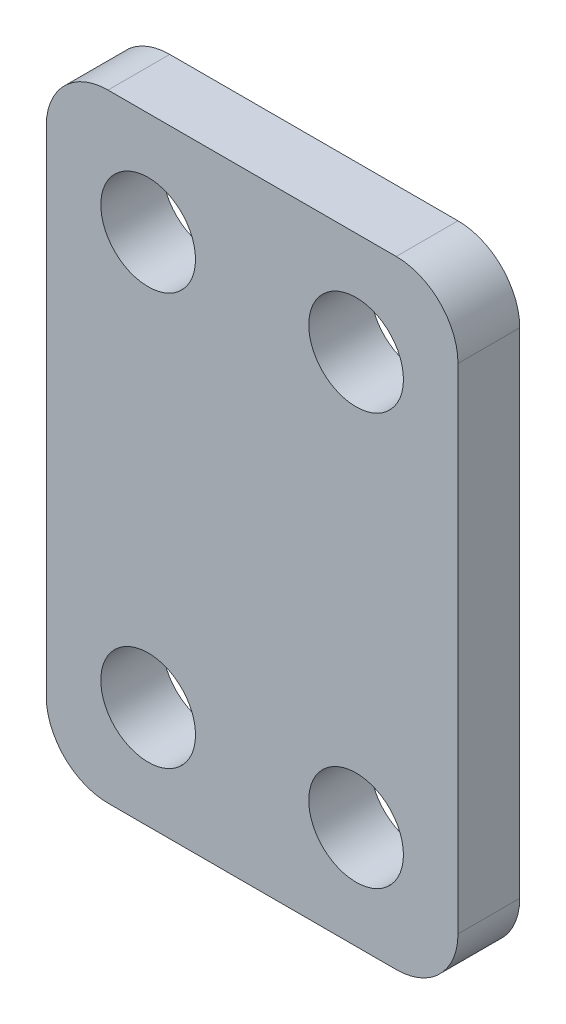
ISO-10303-21;
HEADER;
FILE_DESCRIPTION(('STEP AP214'),'2;1');
FILE_NAME('part.step','',(''),(''),'','','');
FILE_SCHEMA(('AUTOMOTIVE_DESIGN { 1 0 10303 214 1 1 1 1 }'));
ENDSEC;
DATA;
#1=APPLICATION_CONTEXT('core data for automotive mechanical design processes');
#2=APPLICATION_PROTOCOL_DEFINITION('international standard','automotive_design',2000,#1);
#3=PRODUCT_CONTEXT('',#1,'mechanical');
#4=PRODUCT('Part','Part','',(#3));
#5=PRODUCT_RELATED_PRODUCT_CATEGORY('part','',(#4));
#6=PRODUCT_DEFINITION_FORMATION('','',#4);
#7=PRODUCT_DEFINITION_CONTEXT('part definition',#1,'design');
#8=PRODUCT_DEFINITION('design','',#6,#7);
#9=PRODUCT_DEFINITION_SHAPE('','',#8);
#10=(LENGTH_UNIT() NAMED_UNIT(*) SI_UNIT(.MILLI.,.METRE.));
#11=(NAMED_UNIT(*) PLANE_ANGLE_UNIT() SI_UNIT($,.RADIAN.));
#12=(NAMED_UNIT(*) SI_UNIT($,.STERADIAN.) SOLID_ANGLE_UNIT());
#13=UNCERTAINTY_MEASURE_WITH_UNIT(LENGTH_MEASURE(1.E-05),#10,'distance_accuracy_value','');
#14=(GEOMETRIC_REPRESENTATION_CONTEXT(3) GLOBAL_UNCERTAINTY_ASSIGNED_CONTEXT((#13)) GLOBAL_UNIT_ASSIGNED_CONTEXT((#10,
#11,#12)) REPRESENTATION_CONTEXT('',''));
#15=CARTESIAN_POINT('',(0.,0.,0.));
#16=DIRECTION('',(0.,0.,1.));
#17=DIRECTION('',(1.,0.,0.));
#18=AXIS2_PLACEMENT_3D('',#15,#16,#17);
#19=CARTESIAN_POINT('',(10.,15.,3.));
#20=DIRECTION('',(-1.,0.,0.));
#21=DIRECTION('',(0.,-1.,0.));
#22=AXIS2_PLACEMENT_3D('',#19,#20,#21);
#23=PLANE('',#22);
#24=DIRECTION('',(0.,1.,0.));
#25=VECTOR('',#24,1.);
#26=CARTESIAN_POINT('',(10.,15.,3.));
#27=LINE('',#26,#25);
#28=CARTESIAN_POINT('',(10.,-12.,3.));
#29=VERTEX_POINT('',#28);
#30=CARTESIAN_POINT('',(10.,12.,3.));
#31=VERTEX_POINT('',#30);
#32=EDGE_CURVE('E124',#29,#31,#27,.T.);
#33=ORIENTED_EDGE('',*,*,#32,.F.);
#34=DIRECTION('',(0.,0.,-1.));
#35=VECTOR('',#34,1.);
#36=CARTESIAN_POINT('',(10.,-12.,3.));
#37=LINE('',#36,#35);
#38=CARTESIAN_POINT('',(10.,-12.,0.));
#39=VERTEX_POINT('',#38);
#40=EDGE_CURVE('E150',#29,#39,#37,.T.);
#41=ORIENTED_EDGE('',*,*,#40,.T.);
#42=DIRECTION('',(0.,1.,0.));
#43=VECTOR('',#42,1.);
#44=CARTESIAN_POINT('',(10.,15.,0.));
#45=LINE('',#44,#43);
#46=CARTESIAN_POINT('',(10.,12.,0.));
#47=VERTEX_POINT('',#46);
#48=EDGE_CURVE('E156',#39,#47,#45,.T.);
#49=ORIENTED_EDGE('',*,*,#48,.T.);
#50=DIRECTION('',(0.,0.,-1.));
#51=VECTOR('',#50,1.);
#52=CARTESIAN_POINT('',(10.,12.,3.));
#53=LINE('',#52,#51);
#54=EDGE_CURVE('E148',#47,#31,#53,.F.);
#55=ORIENTED_EDGE('',*,*,#54,.T.);
#56=EDGE_LOOP('',(#33,#41,#49,#55));
#57=FACE_BOUND('',#56,.T.);
#58=ADVANCED_FACE('F32',(#57),#23,.F.);
#59=CARTESIAN_POINT('',(-10.,15.,3.));
#60=DIRECTION('',(0.,-1.,0.));
#61=DIRECTION('',(0.,0.,-1.));
#62=AXIS2_PLACEMENT_3D('',#59,#60,#61);
#63=PLANE('',#62);
#64=DIRECTION('',(-1.,0.,0.));
#65=VECTOR('',#64,1.);
#66=CARTESIAN_POINT('',(-10.,15.,3.));
#67=LINE('',#66,#65);
#68=CARTESIAN_POINT('',(7.,15.,3.));
#69=VERTEX_POINT('',#68);
#70=CARTESIAN_POINT('',(-7.,15.,3.));
#71=VERTEX_POINT('',#70);
#72=EDGE_CURVE('E127',#69,#71,#67,.T.);
#73=ORIENTED_EDGE('',*,*,#72,.F.);
#74=DIRECTION('',(0.,0.,-1.));
#75=VECTOR('',#74,1.);
#76=CARTESIAN_POINT('',(7.,15.,3.));
#77=LINE('',#76,#75);
#78=CARTESIAN_POINT('',(7.,15.,0.));
#79=VERTEX_POINT('',#78);
#80=EDGE_CURVE('E11',#69,#79,#77,.T.);
#81=ORIENTED_EDGE('',*,*,#80,.T.);
#82=DIRECTION('',(-1.,0.,0.));
#83=VECTOR('',#82,1.);
#84=CARTESIAN_POINT('',(-10.,15.,0.));
#85=LINE('',#84,#83);
#86=CARTESIAN_POINT('',(-7.,15.,0.));
#87=VERTEX_POINT('',#86);
#88=EDGE_CURVE('E129',#79,#87,#85,.T.);
#89=ORIENTED_EDGE('',*,*,#88,.T.);
#90=DIRECTION('',(0.,0.,-1.));
#91=VECTOR('',#90,1.);
#92=CARTESIAN_POINT('',(-7.,15.,3.));
#93=LINE('',#92,#91);
#94=EDGE_CURVE('E40',#87,#71,#93,.F.);
#95=ORIENTED_EDGE('',*,*,#94,.T.);
#96=EDGE_LOOP('',(#73,#81,#89,#95));
#97=FACE_BOUND('',#96,.T.);
#98=ADVANCED_FACE('F217',(#97),#63,.F.);
#99=CARTESIAN_POINT('',(-10.,15.,3.));
#100=DIRECTION('',(1.,0.,0.));
#101=DIRECTION('',(0.,1.,0.));
#102=AXIS2_PLACEMENT_3D('',#99,#100,#101);
#103=PLANE('',#102);
#104=DIRECTION('',(0.,-1.,0.));
#105=VECTOR('',#104,1.);
#106=CARTESIAN_POINT('',(-10.,15.,0.));
#107=LINE('',#106,#105);
#108=CARTESIAN_POINT('',(-10.,12.,0.));
#109=VERTEX_POINT('',#108);
#110=CARTESIAN_POINT('',(-10.,-12.,0.));
#111=VERTEX_POINT('',#110);
#112=EDGE_CURVE('E125',#109,#111,#107,.T.);
#113=ORIENTED_EDGE('',*,*,#112,.T.);
#114=DIRECTION('',(0.,0.,-1.));
#115=VECTOR('',#114,1.);
#116=CARTESIAN_POINT('',(-10.,-12.,3.));
#117=LINE('',#116,#115);
#118=CARTESIAN_POINT('',(-10.,-12.,3.));
#119=VERTEX_POINT('',#118);
#120=EDGE_CURVE('E103',#111,#119,#117,.F.);
#121=ORIENTED_EDGE('',*,*,#120,.T.);
#122=DIRECTION('',(0.,-1.,0.));
#123=VECTOR('',#122,1.);
#124=CARTESIAN_POINT('',(-10.,15.,3.));
#125=LINE('',#124,#123);
#126=CARTESIAN_POINT('',(-10.,12.,3.));
#127=VERTEX_POINT('',#126);
#128=EDGE_CURVE('E168',#127,#119,#125,.T.);
#129=ORIENTED_EDGE('',*,*,#128,.F.);
#130=DIRECTION('',(0.,0.,-1.));
#131=VECTOR('',#130,1.);
#132=CARTESIAN_POINT('',(-10.,12.,3.));
#133=LINE('',#132,#131);
#134=EDGE_CURVE('E108',#127,#109,#133,.T.);
#135=ORIENTED_EDGE('',*,*,#134,.T.);
#136=EDGE_LOOP('',(#113,#121,#129,#135));
#137=FACE_BOUND('',#136,.T.);
#138=ADVANCED_FACE('F215',(#137),#103,.F.);
#139=CARTESIAN_POINT('',(-10.,-15.,3.));
#140=DIRECTION('',(0.,1.,0.));
#141=DIRECTION('',(0.,0.,1.));
#142=AXIS2_PLACEMENT_3D('',#139,#140,#141);
#143=PLANE('',#142);
#144=DIRECTION('',(1.,0.,0.));
#145=VECTOR('',#144,1.);
#146=CARTESIAN_POINT('',(-10.,-15.,3.));
#147=LINE('',#146,#145);
#148=CARTESIAN_POINT('',(-7.,-15.,3.));
#149=VERTEX_POINT('',#148);
#150=CARTESIAN_POINT('',(7.,-15.,3.));
#151=VERTEX_POINT('',#150);
#152=EDGE_CURVE('E118',#149,#151,#147,.T.);
#153=ORIENTED_EDGE('',*,*,#152,.F.);
#154=DIRECTION('',(0.,0.,-1.));
#155=VECTOR('',#154,1.);
#156=CARTESIAN_POINT('',(-7.,-15.,3.));
#157=LINE('',#156,#155);
#158=CARTESIAN_POINT('',(-7.,-15.,0.));
#159=VERTEX_POINT('',#158);
#160=EDGE_CURVE('E102',#149,#159,#157,.T.);
#161=ORIENTED_EDGE('',*,*,#160,.T.);
#162=DIRECTION('',(1.,0.,0.));
#163=VECTOR('',#162,1.);
#164=CARTESIAN_POINT('',(-10.,-15.,0.));
#165=LINE('',#164,#163);
#166=CARTESIAN_POINT('',(7.,-15.,0.));
#167=VERTEX_POINT('',#166);
#168=EDGE_CURVE('E115',#159,#167,#165,.T.);
#169=ORIENTED_EDGE('',*,*,#168,.T.);
#170=DIRECTION('',(0.,0.,-1.));
#171=VECTOR('',#170,1.);
#172=CARTESIAN_POINT('',(7.,-15.,3.));
#173=LINE('',#172,#171);
#174=EDGE_CURVE('E120',#167,#151,#173,.F.);
#175=ORIENTED_EDGE('',*,*,#174,.T.);
#176=EDGE_LOOP('',(#153,#161,#169,#175));
#177=FACE_BOUND('',#176,.T.);
#178=ADVANCED_FACE('F114',(#177),#143,.F.);
#179=CARTESIAN_POINT('',(0.,0.,3.));
#180=DIRECTION('',(0.,0.,1.));
#181=DIRECTION('',(1.,0.,0.));
#182=AXIS2_PLACEMENT_3D('',#179,#180,#181);
#183=PLANE('',#182);
#184=CARTESIAN_POINT('',(5.05,-9.99999999999999,3.));
#185=DIRECTION('',(0.,0.,1.));
#186=DIRECTION('',(1.,0.,0.));
#187=AXIS2_PLACEMENT_3D('',#184,#185,#186);
#188=CIRCLE('',#187,2.3);
#189=CARTESIAN_POINT('',(7.35,-9.99999999999999,3.));
#190=VERTEX_POINT('',#189);
#191=EDGE_CURVE('E187',#190,#190,#188,.T.);
#192=ORIENTED_EDGE('',*,*,#191,.F.);
#193=EDGE_LOOP('',(#192));
#194=FACE_BOUND('',#193,.T.);
#195=CARTESIAN_POINT('',(-5.05,-9.99999999999999,3.));
#196=DIRECTION('',(0.,0.,1.));
#197=DIRECTION('',(1.,0.,0.));
#198=AXIS2_PLACEMENT_3D('',#195,#196,#197);
#199=CIRCLE('',#198,2.3);
#200=CARTESIAN_POINT('',(-2.75,-9.99999999999999,3.));
#201=VERTEX_POINT('',#200);
#202=EDGE_CURVE('E181',#201,#201,#199,.T.);
#203=ORIENTED_EDGE('',*,*,#202,.F.);
#204=EDGE_LOOP('',(#203));
#205=FACE_BOUND('',#204,.T.);
#206=CARTESIAN_POINT('',(5.05,10.,3.));
#207=DIRECTION('',(0.,0.,1.));
#208=DIRECTION('',(1.,0.,0.));
#209=AXIS2_PLACEMENT_3D('',#206,#207,#208);
#210=CIRCLE('',#209,2.3);
#211=CARTESIAN_POINT('',(7.35,10.,3.));
#212=VERTEX_POINT('',#211);
#213=EDGE_CURVE('E175',#212,#212,#210,.T.);
#214=ORIENTED_EDGE('',*,*,#213,.F.);
#215=EDGE_LOOP('',(#214));
#216=FACE_BOUND('',#215,.T.);
#217=CARTESIAN_POINT('',(-5.05,10.,3.));
#218=DIRECTION('',(0.,0.,1.));
#219=DIRECTION('',(1.,0.,0.));
#220=AXIS2_PLACEMENT_3D('',#217,#218,#219);
#221=CIRCLE('',#220,2.3);
#222=CARTESIAN_POINT('',(-2.75,10.,3.));
#223=VERTEX_POINT('',#222);
#224=EDGE_CURVE('E164',#223,#223,#221,.T.);
#225=ORIENTED_EDGE('',*,*,#224,.F.);
#226=EDGE_LOOP('',(#225));
#227=FACE_BOUND('',#226,.T.);
#228=ORIENTED_EDGE('',*,*,#128,.T.);
#229=CARTESIAN_POINT('',(-7.,-12.,3.));
#230=DIRECTION('',(0.,0.,1.));
#231=DIRECTION('',(1.,0.,0.));
#232=AXIS2_PLACEMENT_3D('',#229,#230,#231);
#233=CIRCLE('',#232,3.);
#234=EDGE_CURVE('E146',#119,#149,#233,.T.);
#235=ORIENTED_EDGE('',*,*,#234,.T.);
#236=ORIENTED_EDGE('',*,*,#152,.T.);
#237=CARTESIAN_POINT('',(7.,-12.,3.));
#238=DIRECTION('',(0.,0.,1.));
#239=DIRECTION('',(1.,0.,0.));
#240=AXIS2_PLACEMENT_3D('',#237,#238,#239);
#241=CIRCLE('',#240,3.);
#242=EDGE_CURVE('E144',#151,#29,#241,.T.);
#243=ORIENTED_EDGE('',*,*,#242,.T.);
#244=ORIENTED_EDGE('',*,*,#32,.T.);
#245=CARTESIAN_POINT('',(7.,12.,3.));
#246=DIRECTION('',(0.,0.,1.));
#247=DIRECTION('',(1.,0.,0.));
#248=AXIS2_PLACEMENT_3D('',#245,#246,#247);
#249=CIRCLE('',#248,3.);
#250=EDGE_CURVE('E53',#31,#69,#249,.T.);
#251=ORIENTED_EDGE('',*,*,#250,.T.);
#252=ORIENTED_EDGE('',*,*,#72,.T.);
#253=CARTESIAN_POINT('',(-7.,12.,3.));
#254=DIRECTION('',(0.,0.,1.));
#255=DIRECTION('',(1.,0.,0.));
#256=AXIS2_PLACEMENT_3D('',#253,#254,#255);
#257=CIRCLE('',#256,3.);
#258=EDGE_CURVE('E141',#71,#127,#257,.T.);
#259=ORIENTED_EDGE('',*,*,#258,.T.);
#260=EDGE_LOOP('',(#228,#235,#236,#243,#244,#251,#252,#259));
#261=FACE_BOUND('',#260,.T.);
#262=ADVANCED_FACE('F202',(#194,#205,#216,#227,#261),#183,.T.);
#263=CARTESIAN_POINT('',(0.,0.,0.));
#264=DIRECTION('',(0.,0.,1.));
#265=DIRECTION('',(1.,0.,0.));
#266=AXIS2_PLACEMENT_3D('',#263,#264,#265);
#267=PLANE('',#266);
#268=CARTESIAN_POINT('',(5.05,-9.99999999999999,0.));
#269=DIRECTION('',(0.,0.,1.));
#270=DIRECTION('',(1.,0.,0.));
#271=AXIS2_PLACEMENT_3D('',#268,#269,#270);
#272=CIRCLE('',#271,2.3);
#273=CARTESIAN_POINT('',(7.35,-9.99999999999999,0.));
#274=VERTEX_POINT('',#273);
#275=EDGE_CURVE('E184',#274,#274,#272,.T.);
#276=ORIENTED_EDGE('',*,*,#275,.T.);
#277=EDGE_LOOP('',(#276));
#278=FACE_BOUND('',#277,.T.);
#279=CARTESIAN_POINT('',(-5.05,-9.99999999999999,0.));
#280=DIRECTION('',(0.,0.,1.));
#281=DIRECTION('',(1.,0.,0.));
#282=AXIS2_PLACEMENT_3D('',#279,#280,#281);
#283=CIRCLE('',#282,2.3);
#284=CARTESIAN_POINT('',(-2.75,-9.99999999999999,0.));
#285=VERTEX_POINT('',#284);
#286=EDGE_CURVE('E178',#285,#285,#283,.T.);
#287=ORIENTED_EDGE('',*,*,#286,.T.);
#288=EDGE_LOOP('',(#287));
#289=FACE_BOUND('',#288,.T.);
#290=CARTESIAN_POINT('',(5.05,10.,0.));
#291=DIRECTION('',(0.,0.,1.));
#292=DIRECTION('',(1.,0.,0.));
#293=AXIS2_PLACEMENT_3D('',#290,#291,#292);
#294=CIRCLE('',#293,2.3);
#295=CARTESIAN_POINT('',(7.35,10.,0.));
#296=VERTEX_POINT('',#295);
#297=EDGE_CURVE('E173',#296,#296,#294,.T.);
#298=ORIENTED_EDGE('',*,*,#297,.T.);
#299=EDGE_LOOP('',(#298));
#300=FACE_BOUND('',#299,.T.);
#301=CARTESIAN_POINT('',(-5.05,10.,0.));
#302=DIRECTION('',(0.,0.,1.));
#303=DIRECTION('',(1.,0.,0.));
#304=AXIS2_PLACEMENT_3D('',#301,#302,#303);
#305=CIRCLE('',#304,2.3);
#306=CARTESIAN_POINT('',(-2.75,10.,0.));
#307=VERTEX_POINT('',#306);
#308=EDGE_CURVE('E161',#307,#307,#305,.T.);
#309=ORIENTED_EDGE('',*,*,#308,.T.);
#310=EDGE_LOOP('',(#309));
#311=FACE_BOUND('',#310,.T.);
#312=ORIENTED_EDGE('',*,*,#168,.F.);
#313=CARTESIAN_POINT('',(-7.,-12.,0.));
#314=DIRECTION('',(0.,0.,1.));
#315=DIRECTION('',(1.,0.,0.));
#316=AXIS2_PLACEMENT_3D('',#313,#314,#315);
#317=CIRCLE('',#316,3.);
#318=EDGE_CURVE('E98',#159,#111,#317,.F.);
#319=ORIENTED_EDGE('',*,*,#318,.T.);
#320=ORIENTED_EDGE('',*,*,#112,.F.);
#321=CARTESIAN_POINT('',(-7.,12.,0.));
#322=DIRECTION('',(0.,0.,1.));
#323=DIRECTION('',(1.,0.,0.));
#324=AXIS2_PLACEMENT_3D('',#321,#322,#323);
#325=CIRCLE('',#324,3.);
#326=EDGE_CURVE('E119',#109,#87,#325,.F.);
#327=ORIENTED_EDGE('',*,*,#326,.T.);
#328=ORIENTED_EDGE('',*,*,#88,.F.);
#329=CARTESIAN_POINT('',(7.,12.,0.));
#330=DIRECTION('',(0.,0.,1.));
#331=DIRECTION('',(1.,0.,0.));
#332=AXIS2_PLACEMENT_3D('',#329,#330,#331);
#333=CIRCLE('',#332,3.);
#334=EDGE_CURVE('E135',#79,#47,#333,.F.);
#335=ORIENTED_EDGE('',*,*,#334,.T.);
#336=ORIENTED_EDGE('',*,*,#48,.F.);
#337=CARTESIAN_POINT('',(7.,-12.,0.));
#338=DIRECTION('',(0.,0.,1.));
#339=DIRECTION('',(1.,0.,0.));
#340=AXIS2_PLACEMENT_3D('',#337,#338,#339);
#341=CIRCLE('',#340,3.);
#342=EDGE_CURVE('E109',#39,#167,#341,.F.);
#343=ORIENTED_EDGE('',*,*,#342,.T.);
#344=EDGE_LOOP('',(#312,#319,#320,#327,#328,#335,#336,#343));
#345=FACE_BOUND('',#344,.T.);
#346=ADVANCED_FACE('F122',(#278,#289,#300,#311,#345),#267,.F.);
#347=CARTESIAN_POINT('',(-5.05,10.,0.));
#348=DIRECTION('',(0.,0.,1.));
#349=DIRECTION('',(1.,0.,0.));
#350=AXIS2_PLACEMENT_3D('',#347,#348,#349);
#351=CYLINDRICAL_SURFACE('',#350,2.3);
#352=ORIENTED_EDGE('',*,*,#308,.F.);
#353=EDGE_LOOP('',(#352));
#354=FACE_BOUND('',#353,.T.);
#355=ORIENTED_EDGE('',*,*,#224,.T.);
#356=EDGE_LOOP('',(#355));
#357=FACE_BOUND('',#356,.T.);
#358=ADVANCED_FACE('F241',(#354,#357),#351,.F.);
#359=CARTESIAN_POINT('',(5.05,10.,0.));
#360=DIRECTION('',(0.,0.,1.));
#361=DIRECTION('',(1.,0.,0.));
#362=AXIS2_PLACEMENT_3D('',#359,#360,#361);
#363=CYLINDRICAL_SURFACE('',#362,2.3);
#364=ORIENTED_EDGE('',*,*,#297,.F.);
#365=EDGE_LOOP('',(#364));
#366=FACE_BOUND('',#365,.T.);
#367=ORIENTED_EDGE('',*,*,#213,.T.);
#368=EDGE_LOOP('',(#367));
#369=FACE_BOUND('',#368,.T.);
#370=ADVANCED_FACE('F245',(#366,#369),#363,.F.);
#371=CARTESIAN_POINT('',(-5.05,-9.99999999999999,0.));
#372=DIRECTION('',(0.,0.,1.));
#373=DIRECTION('',(1.,0.,0.));
#374=AXIS2_PLACEMENT_3D('',#371,#372,#373);
#375=CYLINDRICAL_SURFACE('',#374,2.3);
#376=ORIENTED_EDGE('',*,*,#286,.F.);
#377=EDGE_LOOP('',(#376));
#378=FACE_BOUND('',#377,.T.);
#379=ORIENTED_EDGE('',*,*,#202,.T.);
#380=EDGE_LOOP('',(#379));
#381=FACE_BOUND('',#380,.T.);
#382=ADVANCED_FACE('F198',(#378,#381),#375,.F.);
#383=CARTESIAN_POINT('',(5.05,-9.99999999999999,0.));
#384=DIRECTION('',(0.,0.,1.));
#385=DIRECTION('',(1.,0.,0.));
#386=AXIS2_PLACEMENT_3D('',#383,#384,#385);
#387=CYLINDRICAL_SURFACE('',#386,2.3);
#388=ORIENTED_EDGE('',*,*,#275,.F.);
#389=EDGE_LOOP('',(#388));
#390=FACE_BOUND('',#389,.T.);
#391=ORIENTED_EDGE('',*,*,#191,.T.);
#392=EDGE_LOOP('',(#391));
#393=FACE_BOUND('',#392,.T.);
#394=ADVANCED_FACE('F195',(#390,#393),#387,.F.);
#395=CARTESIAN_POINT('',(-7.,-12.,3.));
#396=DIRECTION('',(0.,0.,-1.));
#397=DIRECTION('',(-1.,0.,0.));
#398=AXIS2_PLACEMENT_3D('',#395,#396,#397);
#399=CYLINDRICAL_SURFACE('',#398,3.);
#400=ORIENTED_EDGE('',*,*,#234,.F.);
#401=ORIENTED_EDGE('',*,*,#120,.F.);
#402=ORIENTED_EDGE('',*,*,#318,.F.);
#403=ORIENTED_EDGE('',*,*,#160,.F.);
#404=EDGE_LOOP('',(#400,#401,#402,#403));
#405=FACE_BOUND('',#404,.T.);
#406=ADVANCED_FACE('F101',(#405),#399,.T.);
#407=CARTESIAN_POINT('',(7.,-12.,3.));
#408=DIRECTION('',(0.,0.,-1.));
#409=DIRECTION('',(-1.,0.,0.));
#410=AXIS2_PLACEMENT_3D('',#407,#408,#409);
#411=CYLINDRICAL_SURFACE('',#410,3.);
#412=ORIENTED_EDGE('',*,*,#242,.F.);
#413=ORIENTED_EDGE('',*,*,#174,.F.);
#414=ORIENTED_EDGE('',*,*,#342,.F.);
#415=ORIENTED_EDGE('',*,*,#40,.F.);
#416=EDGE_LOOP('',(#412,#413,#414,#415));
#417=FACE_BOUND('',#416,.T.);
#418=ADVANCED_FACE('F221',(#417),#411,.T.);
#419=CARTESIAN_POINT('',(7.,12.,3.));
#420=DIRECTION('',(0.,0.,-1.));
#421=DIRECTION('',(-1.,0.,0.));
#422=AXIS2_PLACEMENT_3D('',#419,#420,#421);
#423=CYLINDRICAL_SURFACE('',#422,3.);
#424=ORIENTED_EDGE('',*,*,#250,.F.);
#425=ORIENTED_EDGE('',*,*,#54,.F.);
#426=ORIENTED_EDGE('',*,*,#334,.F.);
#427=ORIENTED_EDGE('',*,*,#80,.F.);
#428=EDGE_LOOP('',(#424,#425,#426,#427));
#429=FACE_BOUND('',#428,.T.);
#430=ADVANCED_FACE('F220',(#429),#423,.T.);
#431=CARTESIAN_POINT('',(-7.,12.,3.));
#432=DIRECTION('',(0.,0.,-1.));
#433=DIRECTION('',(-1.,0.,0.));
#434=AXIS2_PLACEMENT_3D('',#431,#432,#433);
#435=CYLINDRICAL_SURFACE('',#434,3.);
#436=ORIENTED_EDGE('',*,*,#258,.F.);
#437=ORIENTED_EDGE('',*,*,#94,.F.);
#438=ORIENTED_EDGE('',*,*,#326,.F.);
#439=ORIENTED_EDGE('',*,*,#134,.F.);
#440=EDGE_LOOP('',(#436,#437,#438,#439));
#441=FACE_BOUND('',#440,.T.);
#442=ADVANCED_FACE('F34',(#441),#435,.T.);
#443=CLOSED_SHELL('',(#58,#98,#138,#178,#262,#346,#358,#370,#382,#394,#406,#418,#430,#442));
#444=MANIFOLD_SOLID_BREP('B2',#443);
#445=ADVANCED_BREP_SHAPE_REPRESENTATION('',(#18,#444),#14);
#446=SHAPE_DEFINITION_REPRESENTATION(#9,#445);
ENDSEC;
END-ISO-10303-21;
